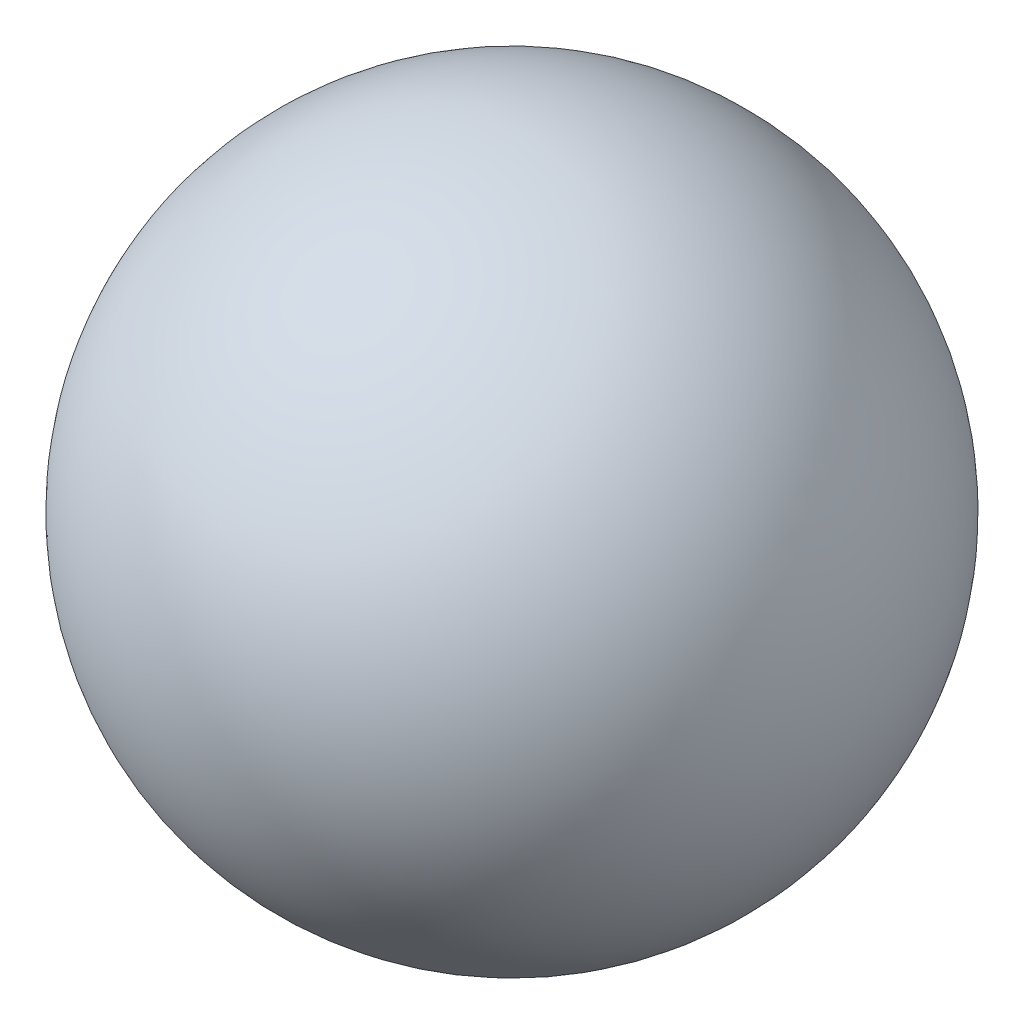
ISO-10303-21;
HEADER;
FILE_DESCRIPTION(('STEP AP214'),'2;1');
FILE_NAME('part.step','',(''),(''),'','','');
FILE_SCHEMA(('AUTOMOTIVE_DESIGN { 1 0 10303 214 1 1 1 1 }'));
ENDSEC;
DATA;
#1=APPLICATION_CONTEXT('core data for automotive mechanical design processes');
#2=APPLICATION_PROTOCOL_DEFINITION('international standard','automotive_design',2000,#1);
#3=PRODUCT_CONTEXT('',#1,'mechanical');
#4=PRODUCT('Part','Part','',(#3));
#5=PRODUCT_RELATED_PRODUCT_CATEGORY('part','',(#4));
#6=PRODUCT_DEFINITION_FORMATION('','',#4);
#7=PRODUCT_DEFINITION_CONTEXT('part definition',#1,'design');
#8=PRODUCT_DEFINITION('design','',#6,#7);
#9=PRODUCT_DEFINITION_SHAPE('','',#8);
#10=(LENGTH_UNIT() NAMED_UNIT(*) SI_UNIT(.MILLI.,.METRE.));
#11=(NAMED_UNIT(*) PLANE_ANGLE_UNIT() SI_UNIT($,.RADIAN.));
#12=(NAMED_UNIT(*) SI_UNIT($,.STERADIAN.) SOLID_ANGLE_UNIT());
#13=UNCERTAINTY_MEASURE_WITH_UNIT(LENGTH_MEASURE(1.E-05),#10,'distance_accuracy_value','');
#14=(GEOMETRIC_REPRESENTATION_CONTEXT(3) GLOBAL_UNCERTAINTY_ASSIGNED_CONTEXT((#13)) GLOBAL_UNIT_ASSIGNED_CONTEXT((#10,
#11,#12)) REPRESENTATION_CONTEXT('',''));
#15=CARTESIAN_POINT('',(0.,0.,0.));
#16=DIRECTION('',(0.,0.,1.));
#17=DIRECTION('',(1.,0.,0.));
#18=AXIS2_PLACEMENT_3D('',#15,#16,#17);
#19=CARTESIAN_POINT('',(0.,0.,0.));
#20=DIRECTION('',(-1.,0.,0.));
#21=DIRECTION('',(0.,1.,0.));
#22=AXIS2_PLACEMENT_3D('',#19,#20,#21);
#23=SPHERICAL_SURFACE('',#22,15.);
#24=CARTESIAN_POINT('',(-15.,0.,0.));
#25=VERTEX_POINT('',#24);
#26=VERTEX_LOOP('',#25);
#27=FACE_BOUND('',#26,.T.);
#28=ADVANCED_FACE('F29',(#27),#23,.T.);
#29=CLOSED_SHELL('',(#28));
#30=MANIFOLD_SOLID_BREP('B2',#29);
#31=ADVANCED_BREP_SHAPE_REPRESENTATION('',(#18,#30),#14);
#32=SHAPE_DEFINITION_REPRESENTATION(#9,#31);
ENDSEC;
END-ISO-10303-21;
